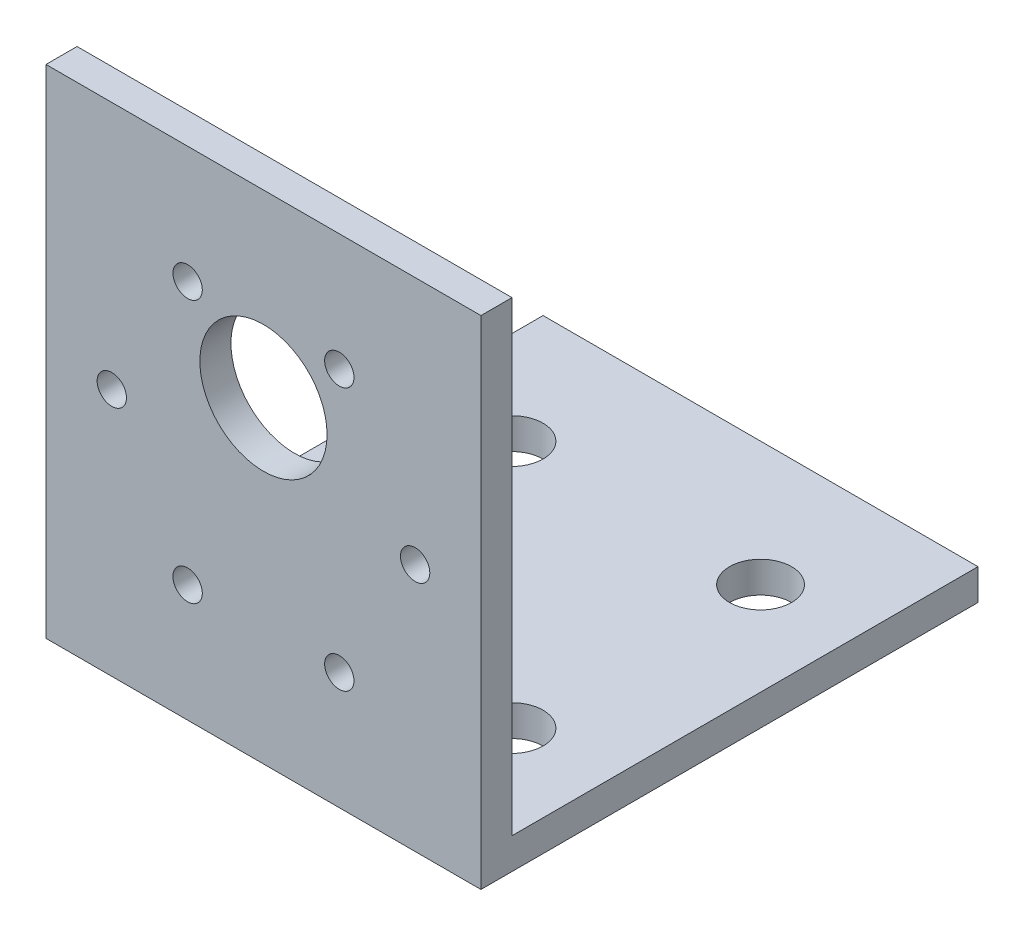
ISO-10303-21;
HEADER;
FILE_DESCRIPTION(('STEP AP214'),'2;1');
FILE_NAME('part.step','',(''),(''),'','','');
FILE_SCHEMA(('AUTOMOTIVE_DESIGN { 1 0 10303 214 1 1 1 1 }'));
ENDSEC;
DATA;
#1=APPLICATION_CONTEXT('core data for automotive mechanical design processes');
#2=APPLICATION_PROTOCOL_DEFINITION('international standard','automotive_design',2000,#1);
#3=PRODUCT_CONTEXT('',#1,'mechanical');
#4=PRODUCT('Part','Part','',(#3));
#5=PRODUCT_RELATED_PRODUCT_CATEGORY('part','',(#4));
#6=PRODUCT_DEFINITION_FORMATION('','',#4);
#7=PRODUCT_DEFINITION_CONTEXT('part definition',#1,'design');
#8=PRODUCT_DEFINITION('design','',#6,#7);
#9=PRODUCT_DEFINITION_SHAPE('','',#8);
#10=(LENGTH_UNIT() NAMED_UNIT(*) SI_UNIT(.MILLI.,.METRE.));
#11=(NAMED_UNIT(*) PLANE_ANGLE_UNIT() SI_UNIT($,.RADIAN.));
#12=(NAMED_UNIT(*) SI_UNIT($,.STERADIAN.) SOLID_ANGLE_UNIT());
#13=UNCERTAINTY_MEASURE_WITH_UNIT(LENGTH_MEASURE(1.E-05),#10,'distance_accuracy_value','');
#14=(GEOMETRIC_REPRESENTATION_CONTEXT(3) GLOBAL_UNCERTAINTY_ASSIGNED_CONTEXT((#13)) GLOBAL_UNIT_ASSIGNED_CONTEXT((#10,
#11,#12)) REPRESENTATION_CONTEXT('',''));
#15=CARTESIAN_POINT('',(0.,0.,0.));
#16=DIRECTION('',(0.,0.,1.));
#17=DIRECTION('',(1.,0.,0.));
#18=AXIS2_PLACEMENT_3D('',#15,#16,#17);
#19=CARTESIAN_POINT('',(0.,0.,3.175));
#20=DIRECTION('',(0.,0.,-1.));
#21=DIRECTION('',(-1.,0.,0.));
#22=AXIS2_PLACEMENT_3D('',#19,#20,#21);
#23=PLANE('',#22);
#24=CARTESIAN_POINT('',(14.475,38.8233937586588,3.175));
#25=DIRECTION('',(0.,0.,1.));
#26=DIRECTION('',(1.,0.,0.));
#27=AXIS2_PLACEMENT_3D('',#24,#25,#26);
#28=CIRCLE('',#27,1.50000000000001);
#29=CARTESIAN_POINT('',(15.975,38.8233937586588,3.175));
#30=VERTEX_POINT('',#29);
#31=EDGE_CURVE('E151',#30,#30,#28,.T.);
#32=ORIENTED_EDGE('',*,*,#31,.F.);
#33=EDGE_LOOP('',(#32));
#34=FACE_BOUND('',#33,.T.);
#35=CARTESIAN_POINT('',(29.975,11.9766062413412,3.175));
#36=DIRECTION('',(0.,0.,1.));
#37=DIRECTION('',(1.,0.,0.));
#38=AXIS2_PLACEMENT_3D('',#35,#36,#37);
#39=CIRCLE('',#38,1.50000000000001);
#40=CARTESIAN_POINT('',(31.475,11.9766062413412,3.175));
#41=VERTEX_POINT('',#40);
#42=EDGE_CURVE('E163',#41,#41,#39,.T.);
#43=ORIENTED_EDGE('',*,*,#42,.F.);
#44=EDGE_LOOP('',(#43));
#45=FACE_BOUND('',#44,.T.);
#46=CARTESIAN_POINT('',(6.725,25.4,3.175));
#47=DIRECTION('',(0.,0.,1.));
#48=DIRECTION('',(1.,0.,0.));
#49=AXIS2_PLACEMENT_3D('',#46,#47,#48);
#50=CIRCLE('',#49,1.5);
#51=CARTESIAN_POINT('',(8.225,25.4,3.175));
#52=VERTEX_POINT('',#51);
#53=EDGE_CURVE('E175',#52,#52,#50,.T.);
#54=ORIENTED_EDGE('',*,*,#53,.F.);
#55=EDGE_LOOP('',(#54));
#56=FACE_BOUND('',#55,.T.);
#57=DIRECTION('',(0.,-1.,0.));
#58=VECTOR('',#57,1.);
#59=CARTESIAN_POINT('',(0.,0.,3.175));
#60=LINE('',#59,#58);
#61=CARTESIAN_POINT('',(0.,50.8,3.175));
#62=VERTEX_POINT('',#61);
#63=CARTESIAN_POINT('',(0.,0.,3.175));
#64=VERTEX_POINT('',#63);
#65=EDGE_CURVE('E187',#62,#64,#60,.T.);
#66=ORIENTED_EDGE('',*,*,#65,.T.);
#67=DIRECTION('',(1.,0.,0.));
#68=VECTOR('',#67,1.);
#69=CARTESIAN_POINT('',(0.,0.,3.175));
#70=LINE('',#69,#68);
#71=CARTESIAN_POINT('',(44.45,0.,3.175));
#72=VERTEX_POINT('',#71);
#73=EDGE_CURVE('E82',#64,#72,#70,.T.);
#74=ORIENTED_EDGE('',*,*,#73,.T.);
#75=DIRECTION('',(0.,1.,0.));
#76=VECTOR('',#75,1.);
#77=CARTESIAN_POINT('',(44.45,0.,3.175));
#78=LINE('',#77,#76);
#79=CARTESIAN_POINT('',(44.45,50.8,3.175));
#80=VERTEX_POINT('',#79);
#81=EDGE_CURVE('E104',#72,#80,#78,.T.);
#82=ORIENTED_EDGE('',*,*,#81,.T.);
#83=DIRECTION('',(-1.,0.,0.));
#84=VECTOR('',#83,1.);
#85=CARTESIAN_POINT('',(0.,50.8,3.175));
#86=LINE('',#85,#84);
#87=EDGE_CURVE('E60',#80,#62,#86,.T.);
#88=ORIENTED_EDGE('',*,*,#87,.T.);
#89=EDGE_LOOP('',(#66,#74,#82,#88));
#90=FACE_BOUND('',#89,.T.);
#91=CARTESIAN_POINT('',(22.225,32.4,3.175));
#92=DIRECTION('',(0.,0.,1.));
#93=DIRECTION('',(1.,0.,0.));
#94=AXIS2_PLACEMENT_3D('',#91,#92,#93);
#95=CIRCLE('',#94,6.50000000000002);
#96=CARTESIAN_POINT('',(28.725,32.4,3.175));
#97=VERTEX_POINT('',#96);
#98=EDGE_CURVE('E181',#97,#97,#95,.T.);
#99=ORIENTED_EDGE('',*,*,#98,.F.);
#100=EDGE_LOOP('',(#99));
#101=FACE_BOUND('',#100,.T.);
#102=CARTESIAN_POINT('',(37.725,25.4,3.175));
#103=DIRECTION('',(0.,0.,1.));
#104=DIRECTION('',(1.,0.,0.));
#105=AXIS2_PLACEMENT_3D('',#102,#103,#104);
#106=CIRCLE('',#105,1.5);
#107=CARTESIAN_POINT('',(39.225,25.4,3.175));
#108=VERTEX_POINT('',#107);
#109=EDGE_CURVE('E169',#108,#108,#106,.T.);
#110=ORIENTED_EDGE('',*,*,#109,.F.);
#111=EDGE_LOOP('',(#110));
#112=FACE_BOUND('',#111,.T.);
#113=CARTESIAN_POINT('',(14.475,11.9766062413412,3.175));
#114=DIRECTION('',(0.,0.,1.));
#115=DIRECTION('',(1.,0.,0.));
#116=AXIS2_PLACEMENT_3D('',#113,#114,#115);
#117=CIRCLE('',#116,1.50000000000001);
#118=CARTESIAN_POINT('',(15.975,11.9766062413412,3.175));
#119=VERTEX_POINT('',#118);
#120=EDGE_CURVE('E157',#119,#119,#117,.T.);
#121=ORIENTED_EDGE('',*,*,#120,.F.);
#122=EDGE_LOOP('',(#121));
#123=FACE_BOUND('',#122,.T.);
#124=CARTESIAN_POINT('',(29.975,38.8233937586588,3.175));
#125=DIRECTION('',(0.,0.,1.));
#126=DIRECTION('',(1.,0.,0.));
#127=AXIS2_PLACEMENT_3D('',#124,#125,#126);
#128=CIRCLE('',#127,1.50000000000002);
#129=CARTESIAN_POINT('',(31.475,38.8233937586588,3.175));
#130=VERTEX_POINT('',#129);
#131=EDGE_CURVE('E131',#130,#130,#128,.T.);
#132=ORIENTED_EDGE('',*,*,#131,.F.);
#133=EDGE_LOOP('',(#132));
#134=FACE_BOUND('',#133,.T.);
#135=ADVANCED_FACE('F34',(#34,#45,#56,#90,#101,#112,#123,#134),#23,.F.);
#136=CARTESIAN_POINT('',(0.,0.,0.));
#137=DIRECTION('',(0.,0.,-1.));
#138=DIRECTION('',(-1.,0.,0.));
#139=AXIS2_PLACEMENT_3D('',#136,#137,#138);
#140=PLANE('',#139);
#141=DIRECTION('',(1.,0.,0.));
#142=VECTOR('',#141,1.);
#143=CARTESIAN_POINT('',(44.45,3.17500000000001,0.));
#144=LINE('',#143,#142);
#145=CARTESIAN_POINT('',(0.,3.17500000000001,0.));
#146=VERTEX_POINT('',#145);
#147=CARTESIAN_POINT('',(44.45,3.17500000000001,0.));
#148=VERTEX_POINT('',#147);
#149=EDGE_CURVE('E51',#146,#148,#144,.T.);
#150=ORIENTED_EDGE('',*,*,#149,.F.);
#151=DIRECTION('',(0.,-1.,0.));
#152=VECTOR('',#151,1.);
#153=CARTESIAN_POINT('',(0.,0.,0.));
#154=LINE('',#153,#152);
#155=CARTESIAN_POINT('',(0.,50.8,0.));
#156=VERTEX_POINT('',#155);
#157=EDGE_CURVE('E184',#156,#146,#154,.T.);
#158=ORIENTED_EDGE('',*,*,#157,.F.);
#159=DIRECTION('',(-1.,0.,0.));
#160=VECTOR('',#159,1.);
#161=CARTESIAN_POINT('',(0.,50.8,0.));
#162=LINE('',#161,#160);
#163=CARTESIAN_POINT('',(44.45,50.8,0.));
#164=VERTEX_POINT('',#163);
#165=EDGE_CURVE('E75',#164,#156,#162,.T.);
#166=ORIENTED_EDGE('',*,*,#165,.F.);
#167=DIRECTION('',(0.,1.,0.));
#168=VECTOR('',#167,1.);
#169=CARTESIAN_POINT('',(44.45,0.,0.));
#170=LINE('',#169,#168);
#171=EDGE_CURVE('E135',#148,#164,#170,.T.);
#172=ORIENTED_EDGE('',*,*,#171,.F.);
#173=EDGE_LOOP('',(#150,#158,#166,#172));
#174=FACE_BOUND('',#173,.T.);
#175=CARTESIAN_POINT('',(14.475,38.8233937586588,0.));
#176=DIRECTION('',(0.,0.,1.));
#177=DIRECTION('',(1.,0.,0.));
#178=AXIS2_PLACEMENT_3D('',#175,#176,#177);
#179=CIRCLE('',#178,1.50000000000001);
#180=CARTESIAN_POINT('',(15.975,38.8233937586588,0.));
#181=VERTEX_POINT('',#180);
#182=EDGE_CURVE('E149',#181,#181,#179,.T.);
#183=ORIENTED_EDGE('',*,*,#182,.T.);
#184=EDGE_LOOP('',(#183));
#185=FACE_BOUND('',#184,.T.);
#186=CARTESIAN_POINT('',(29.975,11.9766062413412,0.));
#187=DIRECTION('',(0.,0.,1.));
#188=DIRECTION('',(1.,0.,0.));
#189=AXIS2_PLACEMENT_3D('',#186,#187,#188);
#190=CIRCLE('',#189,1.50000000000001);
#191=CARTESIAN_POINT('',(31.475,11.9766062413412,0.));
#192=VERTEX_POINT('',#191);
#193=EDGE_CURVE('E160',#192,#192,#190,.T.);
#194=ORIENTED_EDGE('',*,*,#193,.T.);
#195=EDGE_LOOP('',(#194));
#196=FACE_BOUND('',#195,.T.);
#197=CARTESIAN_POINT('',(6.725,25.4,0.));
#198=DIRECTION('',(0.,0.,1.));
#199=DIRECTION('',(1.,0.,0.));
#200=AXIS2_PLACEMENT_3D('',#197,#198,#199);
#201=CIRCLE('',#200,1.5);
#202=CARTESIAN_POINT('',(8.225,25.4,0.));
#203=VERTEX_POINT('',#202);
#204=EDGE_CURVE('E172',#203,#203,#201,.T.);
#205=ORIENTED_EDGE('',*,*,#204,.T.);
#206=EDGE_LOOP('',(#205));
#207=FACE_BOUND('',#206,.T.);
#208=CARTESIAN_POINT('',(22.225,32.4,0.));
#209=DIRECTION('',(0.,0.,1.));
#210=DIRECTION('',(1.,0.,0.));
#211=AXIS2_PLACEMENT_3D('',#208,#209,#210);
#212=CIRCLE('',#211,6.50000000000002);
#213=CARTESIAN_POINT('',(28.725,32.4,0.));
#214=VERTEX_POINT('',#213);
#215=EDGE_CURVE('E178',#214,#214,#212,.T.);
#216=ORIENTED_EDGE('',*,*,#215,.T.);
#217=EDGE_LOOP('',(#216));
#218=FACE_BOUND('',#217,.T.);
#219=CARTESIAN_POINT('',(37.725,25.4,0.));
#220=DIRECTION('',(0.,0.,1.));
#221=DIRECTION('',(1.,0.,0.));
#222=AXIS2_PLACEMENT_3D('',#219,#220,#221);
#223=CIRCLE('',#222,1.5);
#224=CARTESIAN_POINT('',(39.225,25.4,0.));
#225=VERTEX_POINT('',#224);
#226=EDGE_CURVE('E166',#225,#225,#223,.T.);
#227=ORIENTED_EDGE('',*,*,#226,.T.);
#228=EDGE_LOOP('',(#227));
#229=FACE_BOUND('',#228,.T.);
#230=CARTESIAN_POINT('',(14.475,11.9766062413412,0.));
#231=DIRECTION('',(0.,0.,1.));
#232=DIRECTION('',(1.,0.,0.));
#233=AXIS2_PLACEMENT_3D('',#230,#231,#232);
#234=CIRCLE('',#233,1.50000000000001);
#235=CARTESIAN_POINT('',(15.975,11.9766062413412,0.));
#236=VERTEX_POINT('',#235);
#237=EDGE_CURVE('E154',#236,#236,#234,.T.);
#238=ORIENTED_EDGE('',*,*,#237,.T.);
#239=EDGE_LOOP('',(#238));
#240=FACE_BOUND('',#239,.T.);
#241=CARTESIAN_POINT('',(29.975,38.8233937586588,0.));
#242=DIRECTION('',(0.,0.,1.));
#243=DIRECTION('',(1.,0.,0.));
#244=AXIS2_PLACEMENT_3D('',#241,#242,#243);
#245=CIRCLE('',#244,1.50000000000002);
#246=CARTESIAN_POINT('',(31.475,38.8233937586588,0.));
#247=VERTEX_POINT('',#246);
#248=EDGE_CURVE('E142',#247,#247,#245,.T.);
#249=ORIENTED_EDGE('',*,*,#248,.T.);
#250=EDGE_LOOP('',(#249));
#251=FACE_BOUND('',#250,.T.);
#252=ADVANCED_FACE('F199',(#174,#185,#196,#207,#218,#229,#240,#251),#140,.T.);
#253=CARTESIAN_POINT('',(0.,0.,3.175));
#254=DIRECTION('',(1.,0.,0.));
#255=DIRECTION('',(0.,0.,-1.));
#256=AXIS2_PLACEMENT_3D('',#253,#254,#255);
#257=PLANE('',#256);
#258=ORIENTED_EDGE('',*,*,#157,.T.);
#259=DIRECTION('',(0.,0.,1.));
#260=VECTOR('',#259,1.);
#261=CARTESIAN_POINT('',(0.,3.175,-47.625));
#262=LINE('',#261,#260);
#263=CARTESIAN_POINT('',(0.,3.175,-47.625));
#264=VERTEX_POINT('',#263);
#265=EDGE_CURVE('E139',#264,#146,#262,.T.);
#266=ORIENTED_EDGE('',*,*,#265,.F.);
#267=DIRECTION('',(0.,1.,0.));
#268=VECTOR('',#267,1.);
#269=CARTESIAN_POINT('',(0.,0.,-47.625));
#270=LINE('',#269,#268);
#271=CARTESIAN_POINT('',(0.,0.,-47.625));
#272=VERTEX_POINT('',#271);
#273=EDGE_CURVE('E113',#272,#264,#270,.T.);
#274=ORIENTED_EDGE('',*,*,#273,.F.);
#275=DIRECTION('',(0.,0.,-1.));
#276=VECTOR('',#275,1.);
#277=CARTESIAN_POINT('',(0.,0.,3.175));
#278=LINE('',#277,#276);
#279=EDGE_CURVE('E11',#64,#272,#278,.T.);
#280=ORIENTED_EDGE('',*,*,#279,.F.);
#281=ORIENTED_EDGE('',*,*,#65,.F.);
#282=DIRECTION('',(0.,0.,-1.));
#283=VECTOR('',#282,1.);
#284=CARTESIAN_POINT('',(0.,50.8,3.175));
#285=LINE('',#284,#283);
#286=EDGE_CURVE('E192',#62,#156,#285,.T.);
#287=ORIENTED_EDGE('',*,*,#286,.T.);
#288=EDGE_LOOP('',(#258,#266,#274,#280,#281,#287));
#289=FACE_BOUND('',#288,.T.);
#290=ADVANCED_FACE('F36',(#289),#257,.F.);
#291=CARTESIAN_POINT('',(0.,0.,3.175));
#292=DIRECTION('',(0.,1.,0.));
#293=DIRECTION('',(-1.,0.,0.));
#294=AXIS2_PLACEMENT_3D('',#291,#292,#293);
#295=PLANE('',#294);
#296=CARTESIAN_POINT('',(9.525,0.,-34.925));
#297=DIRECTION('',(0.,1.,0.));
#298=DIRECTION('',(-1.,0.,0.));
#299=AXIS2_PLACEMENT_3D('',#296,#297,#298);
#300=CIRCLE('',#299,3.175);
#301=CARTESIAN_POINT('',(6.35,0.,-34.925));
#302=VERTEX_POINT('',#301);
#303=EDGE_CURVE('E264',#302,#302,#300,.T.);
#304=ORIENTED_EDGE('',*,*,#303,.T.);
#305=EDGE_LOOP('',(#304));
#306=FACE_BOUND('',#305,.T.);
#307=CARTESIAN_POINT('',(9.525,0.,-9.525));
#308=DIRECTION('',(0.,1.,0.));
#309=DIRECTION('',(-1.,0.,0.));
#310=AXIS2_PLACEMENT_3D('',#307,#308,#309);
#311=CIRCLE('',#310,3.175);
#312=CARTESIAN_POINT('',(6.35,0.,-9.525));
#313=VERTEX_POINT('',#312);
#314=EDGE_CURVE('E268',#313,#313,#311,.T.);
#315=ORIENTED_EDGE('',*,*,#314,.T.);
#316=EDGE_LOOP('',(#315));
#317=FACE_BOUND('',#316,.T.);
#318=CARTESIAN_POINT('',(34.925,0.,-34.925));
#319=DIRECTION('',(0.,1.,0.));
#320=DIRECTION('',(-1.,0.,0.));
#321=AXIS2_PLACEMENT_3D('',#318,#319,#320);
#322=CIRCLE('',#321,3.175);
#323=CARTESIAN_POINT('',(31.75,0.,-34.925));
#324=VERTEX_POINT('',#323);
#325=EDGE_CURVE('E272',#324,#324,#322,.T.);
#326=ORIENTED_EDGE('',*,*,#325,.T.);
#327=EDGE_LOOP('',(#326));
#328=FACE_BOUND('',#327,.T.);
#329=CARTESIAN_POINT('',(34.925,0.,-9.525));
#330=DIRECTION('',(0.,1.,0.));
#331=DIRECTION('',(-1.,0.,0.));
#332=AXIS2_PLACEMENT_3D('',#329,#330,#331);
#333=CIRCLE('',#332,3.175);
#334=CARTESIAN_POINT('',(31.75,0.,-9.525));
#335=VERTEX_POINT('',#334);
#336=EDGE_CURVE('E120',#335,#335,#333,.T.);
#337=ORIENTED_EDGE('',*,*,#336,.T.);
#338=EDGE_LOOP('',(#337));
#339=FACE_BOUND('',#338,.T.);
#340=ORIENTED_EDGE('',*,*,#279,.T.);
#341=DIRECTION('',(-1.,0.,0.));
#342=VECTOR('',#341,1.);
#343=CARTESIAN_POINT('',(44.45,0.,-47.625));
#344=LINE('',#343,#342);
#345=CARTESIAN_POINT('',(44.45,0.,-47.625));
#346=VERTEX_POINT('',#345);
#347=EDGE_CURVE('E108',#346,#272,#344,.T.);
#348=ORIENTED_EDGE('',*,*,#347,.F.);
#349=DIRECTION('',(0.,0.,-1.));
#350=VECTOR('',#349,1.);
#351=CARTESIAN_POINT('',(44.45,0.,3.175));
#352=LINE('',#351,#350);
#353=EDGE_CURVE('E43',#72,#346,#352,.T.);
#354=ORIENTED_EDGE('',*,*,#353,.F.);
#355=ORIENTED_EDGE('',*,*,#73,.F.);
#356=EDGE_LOOP('',(#340,#348,#354,#355));
#357=FACE_BOUND('',#356,.T.);
#358=ADVANCED_FACE('F109',(#306,#317,#328,#339,#357),#295,.F.);
#359=CARTESIAN_POINT('',(44.45,0.,3.175));
#360=DIRECTION('',(-1.,0.,0.));
#361=DIRECTION('',(0.,-1.,0.));
#362=AXIS2_PLACEMENT_3D('',#359,#360,#361);
#363=PLANE('',#362);
#364=ORIENTED_EDGE('',*,*,#353,.T.);
#365=DIRECTION('',(0.,-1.,0.));
#366=VECTOR('',#365,1.);
#367=CARTESIAN_POINT('',(44.45,0.,-47.625));
#368=LINE('',#367,#366);
#369=CARTESIAN_POINT('',(44.45,3.17500000000001,-47.625));
#370=VERTEX_POINT('',#369);
#371=EDGE_CURVE('E102',#370,#346,#368,.T.);
#372=ORIENTED_EDGE('',*,*,#371,.F.);
#373=DIRECTION('',(0.,0.,1.));
#374=VECTOR('',#373,1.);
#375=CARTESIAN_POINT('',(44.45,3.17500000000001,-47.625));
#376=LINE('',#375,#374);
#377=EDGE_CURVE('E128',#370,#148,#376,.T.);
#378=ORIENTED_EDGE('',*,*,#377,.T.);
#379=ORIENTED_EDGE('',*,*,#171,.T.);
#380=DIRECTION('',(0.,0.,-1.));
#381=VECTOR('',#380,1.);
#382=CARTESIAN_POINT('',(44.45,50.8,3.175));
#383=LINE('',#382,#381);
#384=EDGE_CURVE('E105',#80,#164,#383,.T.);
#385=ORIENTED_EDGE('',*,*,#384,.F.);
#386=ORIENTED_EDGE('',*,*,#81,.F.);
#387=EDGE_LOOP('',(#364,#372,#378,#379,#385,#386));
#388=FACE_BOUND('',#387,.T.);
#389=ADVANCED_FACE('F99',(#388),#363,.F.);
#390=CARTESIAN_POINT('',(0.,50.8,3.175));
#391=DIRECTION('',(0.,-1.,0.));
#392=DIRECTION('',(1.,0.,0.));
#393=AXIS2_PLACEMENT_3D('',#390,#391,#392);
#394=PLANE('',#393);
#395=ORIENTED_EDGE('',*,*,#165,.T.);
#396=ORIENTED_EDGE('',*,*,#286,.F.);
#397=ORIENTED_EDGE('',*,*,#87,.F.);
#398=ORIENTED_EDGE('',*,*,#384,.T.);
#399=EDGE_LOOP('',(#395,#396,#397,#398));
#400=FACE_BOUND('',#399,.T.);
#401=ADVANCED_FACE('F198',(#400),#394,.F.);
#402=CARTESIAN_POINT('',(22.225,32.4,3.175));
#403=DIRECTION('',(0.,0.,-1.));
#404=DIRECTION('',(-1.,0.,0.));
#405=AXIS2_PLACEMENT_3D('',#402,#403,#404);
#406=CYLINDRICAL_SURFACE('',#405,6.50000000000002);
#407=ORIENTED_EDGE('',*,*,#98,.T.);
#408=EDGE_LOOP('',(#407));
#409=FACE_BOUND('',#408,.T.);
#410=ORIENTED_EDGE('',*,*,#215,.F.);
#411=EDGE_LOOP('',(#410));
#412=FACE_BOUND('',#411,.T.);
#413=ADVANCED_FACE('F246',(#409,#412),#406,.F.);
#414=CARTESIAN_POINT('',(6.725,25.4,3.175));
#415=DIRECTION('',(0.,0.,-1.));
#416=DIRECTION('',(-1.,0.,0.));
#417=AXIS2_PLACEMENT_3D('',#414,#415,#416);
#418=CYLINDRICAL_SURFACE('',#417,1.5);
#419=ORIENTED_EDGE('',*,*,#53,.T.);
#420=EDGE_LOOP('',(#419));
#421=FACE_BOUND('',#420,.T.);
#422=ORIENTED_EDGE('',*,*,#204,.F.);
#423=EDGE_LOOP('',(#422));
#424=FACE_BOUND('',#423,.T.);
#425=ADVANCED_FACE('F242',(#421,#424),#418,.F.);
#426=CARTESIAN_POINT('',(37.725,25.4,3.175));
#427=DIRECTION('',(0.,0.,-1.));
#428=DIRECTION('',(-1.,0.,0.));
#429=AXIS2_PLACEMENT_3D('',#426,#427,#428);
#430=CYLINDRICAL_SURFACE('',#429,1.5);
#431=ORIENTED_EDGE('',*,*,#109,.T.);
#432=EDGE_LOOP('',(#431));
#433=FACE_BOUND('',#432,.T.);
#434=ORIENTED_EDGE('',*,*,#226,.F.);
#435=EDGE_LOOP('',(#434));
#436=FACE_BOUND('',#435,.T.);
#437=ADVANCED_FACE('F238',(#433,#436),#430,.F.);
#438=CARTESIAN_POINT('',(29.975,11.9766062413412,3.175));
#439=DIRECTION('',(0.,0.,-1.));
#440=DIRECTION('',(-1.,0.,0.));
#441=AXIS2_PLACEMENT_3D('',#438,#439,#440);
#442=CYLINDRICAL_SURFACE('',#441,1.50000000000001);
#443=ORIENTED_EDGE('',*,*,#42,.T.);
#444=EDGE_LOOP('',(#443));
#445=FACE_BOUND('',#444,.T.);
#446=ORIENTED_EDGE('',*,*,#193,.F.);
#447=EDGE_LOOP('',(#446));
#448=FACE_BOUND('',#447,.T.);
#449=ADVANCED_FACE('F234',(#445,#448),#442,.F.);
#450=CARTESIAN_POINT('',(14.475,11.9766062413412,3.175));
#451=DIRECTION('',(0.,0.,-1.));
#452=DIRECTION('',(-1.,0.,0.));
#453=AXIS2_PLACEMENT_3D('',#450,#451,#452);
#454=CYLINDRICAL_SURFACE('',#453,1.50000000000001);
#455=ORIENTED_EDGE('',*,*,#120,.T.);
#456=EDGE_LOOP('',(#455));
#457=FACE_BOUND('',#456,.T.);
#458=ORIENTED_EDGE('',*,*,#237,.F.);
#459=EDGE_LOOP('',(#458));
#460=FACE_BOUND('',#459,.T.);
#461=ADVANCED_FACE('F227',(#457,#460),#454,.F.);
#462=CARTESIAN_POINT('',(14.475,38.8233937586588,3.175));
#463=DIRECTION('',(0.,0.,-1.));
#464=DIRECTION('',(-1.,0.,0.));
#465=AXIS2_PLACEMENT_3D('',#462,#463,#464);
#466=CYLINDRICAL_SURFACE('',#465,1.50000000000001);
#467=ORIENTED_EDGE('',*,*,#31,.T.);
#468=EDGE_LOOP('',(#467));
#469=FACE_BOUND('',#468,.T.);
#470=ORIENTED_EDGE('',*,*,#182,.F.);
#471=EDGE_LOOP('',(#470));
#472=FACE_BOUND('',#471,.T.);
#473=ADVANCED_FACE('F219',(#469,#472),#466,.F.);
#474=CARTESIAN_POINT('',(29.975,38.8233937586588,3.175));
#475=DIRECTION('',(0.,0.,-1.));
#476=DIRECTION('',(-1.,0.,0.));
#477=AXIS2_PLACEMENT_3D('',#474,#475,#476);
#478=CYLINDRICAL_SURFACE('',#477,1.50000000000002);
#479=ORIENTED_EDGE('',*,*,#131,.T.);
#480=EDGE_LOOP('',(#479));
#481=FACE_BOUND('',#480,.T.);
#482=ORIENTED_EDGE('',*,*,#248,.F.);
#483=EDGE_LOOP('',(#482));
#484=FACE_BOUND('',#483,.T.);
#485=ADVANCED_FACE('F215',(#481,#484),#478,.F.);
#486=CARTESIAN_POINT('',(44.45,3.17500000000001,-47.625));
#487=DIRECTION('',(0.,-1.,0.));
#488=DIRECTION('',(1.,0.,0.));
#489=AXIS2_PLACEMENT_3D('',#486,#487,#488);
#490=PLANE('',#489);
#491=CARTESIAN_POINT('',(9.525,3.175,-34.925));
#492=DIRECTION('',(0.,1.,0.));
#493=DIRECTION('',(-1.,0.,0.));
#494=AXIS2_PLACEMENT_3D('',#491,#492,#493);
#495=CIRCLE('',#494,3.175);
#496=CARTESIAN_POINT('',(6.35,3.175,-34.925));
#497=VERTEX_POINT('',#496);
#498=EDGE_CURVE('E286',#497,#497,#495,.T.);
#499=ORIENTED_EDGE('',*,*,#498,.F.);
#500=EDGE_LOOP('',(#499));
#501=FACE_BOUND('',#500,.T.);
#502=CARTESIAN_POINT('',(9.525,3.175,-9.525));
#503=DIRECTION('',(0.,1.,0.));
#504=DIRECTION('',(-1.,0.,0.));
#505=AXIS2_PLACEMENT_3D('',#502,#503,#504);
#506=CIRCLE('',#505,3.175);
#507=CARTESIAN_POINT('',(6.35,3.175,-9.525));
#508=VERTEX_POINT('',#507);
#509=EDGE_CURVE('E282',#508,#508,#506,.T.);
#510=ORIENTED_EDGE('',*,*,#509,.F.);
#511=EDGE_LOOP('',(#510));
#512=FACE_BOUND('',#511,.T.);
#513=CARTESIAN_POINT('',(34.925,3.17500000000001,-34.925));
#514=DIRECTION('',(0.,1.,0.));
#515=DIRECTION('',(-1.,0.,0.));
#516=AXIS2_PLACEMENT_3D('',#513,#514,#515);
#517=CIRCLE('',#516,3.175);
#518=CARTESIAN_POINT('',(31.75,3.17500000000001,-34.925));
#519=VERTEX_POINT('',#518);
#520=EDGE_CURVE('E278',#519,#519,#517,.T.);
#521=ORIENTED_EDGE('',*,*,#520,.F.);
#522=EDGE_LOOP('',(#521));
#523=FACE_BOUND('',#522,.T.);
#524=CARTESIAN_POINT('',(34.925,3.17500000000001,-9.525));
#525=DIRECTION('',(0.,1.,0.));
#526=DIRECTION('',(-1.,0.,0.));
#527=AXIS2_PLACEMENT_3D('',#524,#525,#526);
#528=CIRCLE('',#527,3.175);
#529=CARTESIAN_POINT('',(31.75,3.17500000000001,-9.525));
#530=VERTEX_POINT('',#529);
#531=EDGE_CURVE('E123',#530,#530,#528,.T.);
#532=ORIENTED_EDGE('',*,*,#531,.F.);
#533=EDGE_LOOP('',(#532));
#534=FACE_BOUND('',#533,.T.);
#535=ORIENTED_EDGE('',*,*,#149,.T.);
#536=ORIENTED_EDGE('',*,*,#377,.F.);
#537=DIRECTION('',(1.,0.,0.));
#538=VECTOR('',#537,1.);
#539=CARTESIAN_POINT('',(44.45,3.17500000000001,-47.625));
#540=LINE('',#539,#538);
#541=EDGE_CURVE('E117',#264,#370,#540,.T.);
#542=ORIENTED_EDGE('',*,*,#541,.F.);
#543=ORIENTED_EDGE('',*,*,#265,.T.);
#544=EDGE_LOOP('',(#535,#536,#542,#543));
#545=FACE_BOUND('',#544,.T.);
#546=ADVANCED_FACE('F218',(#501,#512,#523,#534,#545),#490,.F.);
#547=CARTESIAN_POINT('',(0.,0.,-47.625));
#548=DIRECTION('',(0.,0.,1.));
#549=DIRECTION('',(1.,0.,0.));
#550=AXIS2_PLACEMENT_3D('',#547,#548,#549);
#551=PLANE('',#550);
#552=ORIENTED_EDGE('',*,*,#371,.T.);
#553=ORIENTED_EDGE('',*,*,#347,.T.);
#554=ORIENTED_EDGE('',*,*,#273,.T.);
#555=ORIENTED_EDGE('',*,*,#541,.T.);
#556=EDGE_LOOP('',(#552,#553,#554,#555));
#557=FACE_BOUND('',#556,.T.);
#558=ADVANCED_FACE('F115',(#557),#551,.F.);
#559=CARTESIAN_POINT('',(34.925,0.,-9.525));
#560=DIRECTION('',(0.,1.,0.));
#561=DIRECTION('',(-1.,0.,0.));
#562=AXIS2_PLACEMENT_3D('',#559,#560,#561);
#563=CYLINDRICAL_SURFACE('',#562,3.175);
#564=ORIENTED_EDGE('',*,*,#336,.F.);
#565=EDGE_LOOP('',(#564));
#566=FACE_BOUND('',#565,.T.);
#567=ORIENTED_EDGE('',*,*,#531,.T.);
#568=EDGE_LOOP('',(#567));
#569=FACE_BOUND('',#568,.T.);
#570=ADVANCED_FACE('F299',(#566,#569),#563,.F.);
#571=CARTESIAN_POINT('',(34.925,0.,-34.925));
#572=DIRECTION('',(0.,1.,0.));
#573=DIRECTION('',(-1.,0.,0.));
#574=AXIS2_PLACEMENT_3D('',#571,#572,#573);
#575=CYLINDRICAL_SURFACE('',#574,3.175);
#576=ORIENTED_EDGE('',*,*,#325,.F.);
#577=EDGE_LOOP('',(#576));
#578=FACE_BOUND('',#577,.T.);
#579=ORIENTED_EDGE('',*,*,#520,.T.);
#580=EDGE_LOOP('',(#579));
#581=FACE_BOUND('',#580,.T.);
#582=ADVANCED_FACE('F301',(#578,#581),#575,.F.);
#583=CARTESIAN_POINT('',(9.525,0.,-9.525));
#584=DIRECTION('',(0.,1.,0.));
#585=DIRECTION('',(-1.,0.,0.));
#586=AXIS2_PLACEMENT_3D('',#583,#584,#585);
#587=CYLINDRICAL_SURFACE('',#586,3.175);
#588=ORIENTED_EDGE('',*,*,#314,.F.);
#589=EDGE_LOOP('',(#588));
#590=FACE_BOUND('',#589,.T.);
#591=ORIENTED_EDGE('',*,*,#509,.T.);
#592=EDGE_LOOP('',(#591));
#593=FACE_BOUND('',#592,.T.);
#594=ADVANCED_FACE('F307',(#590,#593),#587,.F.);
#595=CARTESIAN_POINT('',(9.525,0.,-34.925));
#596=DIRECTION('',(0.,1.,0.));
#597=DIRECTION('',(-1.,0.,0.));
#598=AXIS2_PLACEMENT_3D('',#595,#596,#597);
#599=CYLINDRICAL_SURFACE('',#598,3.175);
#600=ORIENTED_EDGE('',*,*,#303,.F.);
#601=EDGE_LOOP('',(#600));
#602=FACE_BOUND('',#601,.T.);
#603=ORIENTED_EDGE('',*,*,#498,.T.);
#604=EDGE_LOOP('',(#603));
#605=FACE_BOUND('',#604,.T.);
#606=ADVANCED_FACE('F291',(#602,#605),#599,.F.);
#607=CLOSED_SHELL('',(#135,#252,#290,#358,#389,#401,#413,#425,#437,#449,#461,#473,#485,#546,
#558,#570,#582,#594,#606));
#608=MANIFOLD_SOLID_BREP('B2',#607);
#609=ADVANCED_BREP_SHAPE_REPRESENTATION('',(#18,#608),#14);
#610=SHAPE_DEFINITION_REPRESENTATION(#9,#609);
ENDSEC;
END-ISO-10303-21;
